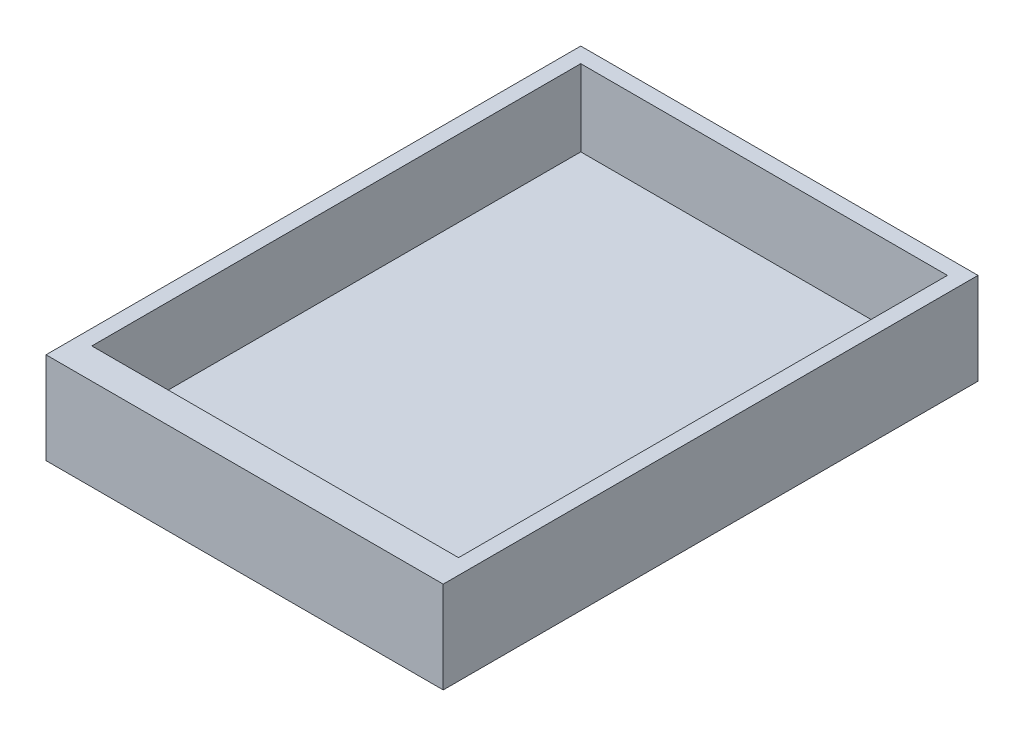
ISO-10303-21;
HEADER;
FILE_DESCRIPTION(('STEP AP214'),'2;1');
FILE_NAME('part.step','',(''),(''),'','','');
FILE_SCHEMA(('AUTOMOTIVE_DESIGN { 1 0 10303 214 1 1 1 1 }'));
ENDSEC;
DATA;
#1=APPLICATION_CONTEXT('core data for automotive mechanical design processes');
#2=APPLICATION_PROTOCOL_DEFINITION('international standard','automotive_design',2000,#1);
#3=PRODUCT_CONTEXT('',#1,'mechanical');
#4=PRODUCT('Part','Part','',(#3));
#5=PRODUCT_RELATED_PRODUCT_CATEGORY('part','',(#4));
#6=PRODUCT_DEFINITION_FORMATION('','',#4);
#7=PRODUCT_DEFINITION_CONTEXT('part definition',#1,'design');
#8=PRODUCT_DEFINITION('design','',#6,#7);
#9=PRODUCT_DEFINITION_SHAPE('','',#8);
#10=(LENGTH_UNIT() NAMED_UNIT(*) SI_UNIT(.MILLI.,.METRE.));
#11=(NAMED_UNIT(*) PLANE_ANGLE_UNIT() SI_UNIT($,.RADIAN.));
#12=(NAMED_UNIT(*) SI_UNIT($,.STERADIAN.) SOLID_ANGLE_UNIT());
#13=UNCERTAINTY_MEASURE_WITH_UNIT(LENGTH_MEASURE(1.E-05),#10,'distance_accuracy_value','');
#14=(GEOMETRIC_REPRESENTATION_CONTEXT(3) GLOBAL_UNCERTAINTY_ASSIGNED_CONTEXT((#13)) GLOBAL_UNIT_ASSIGNED_CONTEXT((#10,
#11,#12)) REPRESENTATION_CONTEXT('',''));
#15=CARTESIAN_POINT('',(0.,0.,0.));
#16=DIRECTION('',(0.,0.,1.));
#17=DIRECTION('',(1.,0.,0.));
#18=AXIS2_PLACEMENT_3D('',#15,#16,#17);
#19=CARTESIAN_POINT('',(41.275,19.05,55.5625));
#20=DIRECTION('',(-1.,0.,0.));
#21=DIRECTION('',(0.,0.,1.));
#22=AXIS2_PLACEMENT_3D('',#19,#20,#21);
#23=PLANE('',#22);
#24=DIRECTION('',(0.,0.,-1.));
#25=VECTOR('',#24,1.);
#26=CARTESIAN_POINT('',(41.275,0.,55.5625));
#27=LINE('',#26,#25);
#28=CARTESIAN_POINT('',(41.275,0.,55.5625));
#29=VERTEX_POINT('',#28);
#30=CARTESIAN_POINT('',(41.275,0.,-55.5625));
#31=VERTEX_POINT('',#30);
#32=EDGE_CURVE('E148',#29,#31,#27,.T.);
#33=ORIENTED_EDGE('',*,*,#32,.T.);
#34=DIRECTION('',(0.,-1.,0.));
#35=VECTOR('',#34,1.);
#36=CARTESIAN_POINT('',(41.275,19.05,-55.5625));
#37=LINE('',#36,#35);
#38=CARTESIAN_POINT('',(41.275,19.05,-55.5625));
#39=VERTEX_POINT('',#38);
#40=EDGE_CURVE('E12',#39,#31,#37,.T.);
#41=ORIENTED_EDGE('',*,*,#40,.F.);
#42=DIRECTION('',(0.,0.,-1.));
#43=VECTOR('',#42,1.);
#44=CARTESIAN_POINT('',(41.275,19.05,55.5625));
#45=LINE('',#44,#43);
#46=CARTESIAN_POINT('',(41.275,19.05,55.5625));
#47=VERTEX_POINT('',#46);
#48=EDGE_CURVE('E149',#47,#39,#45,.T.);
#49=ORIENTED_EDGE('',*,*,#48,.F.);
#50=DIRECTION('',(0.,-1.,0.));
#51=VECTOR('',#50,1.);
#52=CARTESIAN_POINT('',(41.275,19.05,55.5625));
#53=LINE('',#52,#51);
#54=EDGE_CURVE('E155',#47,#29,#53,.T.);
#55=ORIENTED_EDGE('',*,*,#54,.T.);
#56=EDGE_LOOP('',(#33,#41,#49,#55));
#57=FACE_BOUND('',#56,.T.);
#58=ADVANCED_FACE('F37',(#57),#23,.F.);
#59=CARTESIAN_POINT('',(-41.275,19.05,-55.5625));
#60=DIRECTION('',(0.,0.,1.));
#61=DIRECTION('',(1.,0.,0.));
#62=AXIS2_PLACEMENT_3D('',#59,#60,#61);
#63=PLANE('',#62);
#64=DIRECTION('',(-1.,0.,0.));
#65=VECTOR('',#64,1.);
#66=CARTESIAN_POINT('',(-41.275,0.,-55.5625));
#67=LINE('',#66,#65);
#68=CARTESIAN_POINT('',(-41.275,0.,-55.5625));
#69=VERTEX_POINT('',#68);
#70=EDGE_CURVE('E158',#31,#69,#67,.T.);
#71=ORIENTED_EDGE('',*,*,#70,.T.);
#72=DIRECTION('',(0.,-1.,0.));
#73=VECTOR('',#72,1.);
#74=CARTESIAN_POINT('',(-41.275,19.05,-55.5625));
#75=LINE('',#74,#73);
#76=CARTESIAN_POINT('',(-41.275,19.05,-55.5625));
#77=VERTEX_POINT('',#76);
#78=EDGE_CURVE('E44',#77,#69,#75,.T.);
#79=ORIENTED_EDGE('',*,*,#78,.F.);
#80=DIRECTION('',(-1.,0.,0.));
#81=VECTOR('',#80,1.);
#82=CARTESIAN_POINT('',(-41.275,19.05,-55.5625));
#83=LINE('',#82,#81);
#84=EDGE_CURVE('E88',#39,#77,#83,.T.);
#85=ORIENTED_EDGE('',*,*,#84,.F.);
#86=ORIENTED_EDGE('',*,*,#40,.T.);
#87=EDGE_LOOP('',(#71,#79,#85,#86));
#88=FACE_BOUND('',#87,.T.);
#89=ADVANCED_FACE('F187',(#88),#63,.F.);
#90=CARTESIAN_POINT('',(-41.275,19.05,55.5625));
#91=DIRECTION('',(1.,0.,0.));
#92=DIRECTION('',(0.,0.,-1.));
#93=AXIS2_PLACEMENT_3D('',#90,#91,#92);
#94=PLANE('',#93);
#95=DIRECTION('',(0.,0.,1.));
#96=VECTOR('',#95,1.);
#97=CARTESIAN_POINT('',(-41.275,0.,55.5625));
#98=LINE('',#97,#96);
#99=CARTESIAN_POINT('',(-41.275,0.,55.5625));
#100=VERTEX_POINT('',#99);
#101=EDGE_CURVE('E160',#69,#100,#98,.T.);
#102=ORIENTED_EDGE('',*,*,#101,.T.);
#103=DIRECTION('',(0.,-1.,0.));
#104=VECTOR('',#103,1.);
#105=CARTESIAN_POINT('',(-41.275,19.05,55.5625));
#106=LINE('',#105,#104);
#107=CARTESIAN_POINT('',(-41.275,19.05,55.5625));
#108=VERTEX_POINT('',#107);
#109=EDGE_CURVE('E164',#108,#100,#106,.T.);
#110=ORIENTED_EDGE('',*,*,#109,.F.);
#111=DIRECTION('',(0.,0.,1.));
#112=VECTOR('',#111,1.);
#113=CARTESIAN_POINT('',(-41.275,19.05,55.5625));
#114=LINE('',#113,#112);
#115=EDGE_CURVE('E152',#77,#108,#114,.T.);
#116=ORIENTED_EDGE('',*,*,#115,.F.);
#117=ORIENTED_EDGE('',*,*,#78,.T.);
#118=EDGE_LOOP('',(#102,#110,#116,#117));
#119=FACE_BOUND('',#118,.T.);
#120=ADVANCED_FACE('F169',(#119),#94,.F.);
#121=CARTESIAN_POINT('',(-41.275,19.05,55.5625));
#122=DIRECTION('',(0.,0.,-1.));
#123=DIRECTION('',(-1.,0.,0.));
#124=AXIS2_PLACEMENT_3D('',#121,#122,#123);
#125=PLANE('',#124);
#126=DIRECTION('',(1.,0.,0.));
#127=VECTOR('',#126,1.);
#128=CARTESIAN_POINT('',(-41.275,0.,55.5625));
#129=LINE('',#128,#127);
#130=EDGE_CURVE('E81',#100,#29,#129,.T.);
#131=ORIENTED_EDGE('',*,*,#130,.T.);
#132=ORIENTED_EDGE('',*,*,#54,.F.);
#133=DIRECTION('',(1.,0.,0.));
#134=VECTOR('',#133,1.);
#135=CARTESIAN_POINT('',(-41.275,19.05,55.5625));
#136=LINE('',#135,#134);
#137=EDGE_CURVE('E60',#108,#47,#136,.T.);
#138=ORIENTED_EDGE('',*,*,#137,.F.);
#139=ORIENTED_EDGE('',*,*,#109,.T.);
#140=EDGE_LOOP('',(#131,#132,#138,#139));
#141=FACE_BOUND('',#140,.T.);
#142=ADVANCED_FACE('F177',(#141),#125,.F.);
#143=CARTESIAN_POINT('',(41.275,19.05,-55.5625));
#144=DIRECTION('',(0.,-1.,0.));
#145=DIRECTION('',(0.,0.,-1.));
#146=AXIS2_PLACEMENT_3D('',#143,#144,#145);
#147=PLANE('',#146);
#148=DIRECTION('',(0.,0.,1.));
#149=VECTOR('',#148,1.);
#150=CARTESIAN_POINT('',(-38.1,19.05,49.2125));
#151=LINE('',#150,#149);
#152=CARTESIAN_POINT('',(-38.1,19.05,-52.3875));
#153=VERTEX_POINT('',#152);
#154=CARTESIAN_POINT('',(-38.1,19.05,49.2125));
#155=VERTEX_POINT('',#154);
#156=EDGE_CURVE('E134',#153,#155,#151,.T.);
#157=ORIENTED_EDGE('',*,*,#156,.F.);
#158=DIRECTION('',(-1.,0.,0.));
#159=VECTOR('',#158,1.);
#160=CARTESIAN_POINT('',(-38.1,19.05,-52.3875));
#161=LINE('',#160,#159);
#162=CARTESIAN_POINT('',(38.1,19.05,-52.3875));
#163=VERTEX_POINT('',#162);
#164=EDGE_CURVE('E127',#163,#153,#161,.T.);
#165=ORIENTED_EDGE('',*,*,#164,.F.);
#166=DIRECTION('',(0.,0.,-1.));
#167=VECTOR('',#166,1.);
#168=CARTESIAN_POINT('',(38.1,19.05,49.2125));
#169=LINE('',#168,#167);
#170=CARTESIAN_POINT('',(38.1,19.05,49.2125));
#171=VERTEX_POINT('',#170);
#172=EDGE_CURVE('E138',#171,#163,#169,.T.);
#173=ORIENTED_EDGE('',*,*,#172,.F.);
#174=DIRECTION('',(1.,0.,0.));
#175=VECTOR('',#174,1.);
#176=CARTESIAN_POINT('',(-38.1,19.05,49.2125));
#177=LINE('',#176,#175);
#178=EDGE_CURVE('E51',#155,#171,#177,.T.);
#179=ORIENTED_EDGE('',*,*,#178,.F.);
#180=EDGE_LOOP('',(#157,#165,#173,#179));
#181=FACE_BOUND('',#180,.T.);
#182=ORIENTED_EDGE('',*,*,#48,.T.);
#183=ORIENTED_EDGE('',*,*,#84,.T.);
#184=ORIENTED_EDGE('',*,*,#115,.T.);
#185=ORIENTED_EDGE('',*,*,#137,.T.);
#186=EDGE_LOOP('',(#182,#183,#184,#185));
#187=FACE_BOUND('',#186,.T.);
#188=ADVANCED_FACE('F179',(#181,#187),#147,.F.);
#189=CARTESIAN_POINT('',(41.275,0.,-55.5625));
#190=DIRECTION('',(0.,-1.,0.));
#191=DIRECTION('',(0.,0.,-1.));
#192=AXIS2_PLACEMENT_3D('',#189,#190,#191);
#193=PLANE('',#192);
#194=ORIENTED_EDGE('',*,*,#32,.F.);
#195=ORIENTED_EDGE('',*,*,#130,.F.);
#196=ORIENTED_EDGE('',*,*,#101,.F.);
#197=ORIENTED_EDGE('',*,*,#70,.F.);
#198=EDGE_LOOP('',(#194,#195,#196,#197));
#199=FACE_BOUND('',#198,.T.);
#200=ADVANCED_FACE('F173',(#199),#193,.T.);
#201=CARTESIAN_POINT('',(41.275,3.175,-55.5625));
#202=DIRECTION('',(0.,-1.,0.));
#203=DIRECTION('',(0.,0.,-1.));
#204=AXIS2_PLACEMENT_3D('',#201,#202,#203);
#205=PLANE('',#204);
#206=DIRECTION('',(0.,0.,-1.));
#207=VECTOR('',#206,1.);
#208=CARTESIAN_POINT('',(38.1,3.17500000000001,49.2125));
#209=LINE('',#208,#207);
#210=CARTESIAN_POINT('',(38.1,3.17500000000001,49.2125));
#211=VERTEX_POINT('',#210);
#212=CARTESIAN_POINT('',(38.1,3.17500000000001,-52.3875));
#213=VERTEX_POINT('',#212);
#214=EDGE_CURVE('E131',#211,#213,#209,.T.);
#215=ORIENTED_EDGE('',*,*,#214,.T.);
#216=DIRECTION('',(-1.,0.,0.));
#217=VECTOR('',#216,1.);
#218=CARTESIAN_POINT('',(-38.1,3.17500000000001,-52.3875));
#219=LINE('',#218,#217);
#220=CARTESIAN_POINT('',(-38.1,3.17500000000001,-52.3875));
#221=VERTEX_POINT('',#220);
#222=EDGE_CURVE('E124',#213,#221,#219,.T.);
#223=ORIENTED_EDGE('',*,*,#222,.T.);
#224=DIRECTION('',(0.,0.,1.));
#225=VECTOR('',#224,1.);
#226=CARTESIAN_POINT('',(-38.1,3.17500000000001,49.2125));
#227=LINE('',#226,#225);
#228=CARTESIAN_POINT('',(-38.1,3.17500000000001,49.2125));
#229=VERTEX_POINT('',#228);
#230=EDGE_CURVE('E111',#221,#229,#227,.T.);
#231=ORIENTED_EDGE('',*,*,#230,.T.);
#232=DIRECTION('',(1.,0.,0.));
#233=VECTOR('',#232,1.);
#234=CARTESIAN_POINT('',(-38.1,3.17500000000001,49.2125));
#235=LINE('',#234,#233);
#236=EDGE_CURVE('E143',#229,#211,#235,.T.);
#237=ORIENTED_EDGE('',*,*,#236,.T.);
#238=EDGE_LOOP('',(#215,#223,#231,#237));
#239=FACE_BOUND('',#238,.T.);
#240=ADVANCED_FACE('F130',(#239),#205,.F.);
#241=CARTESIAN_POINT('',(-38.1,-127.,-52.3875));
#242=DIRECTION('',(0.,0.,-1.));
#243=DIRECTION('',(-1.,0.,0.));
#244=AXIS2_PLACEMENT_3D('',#241,#242,#243);
#245=PLANE('',#244);
#246=DIRECTION('',(0.,1.,0.));
#247=VECTOR('',#246,1.);
#248=CARTESIAN_POINT('',(38.1,-127.,-52.3875));
#249=LINE('',#248,#247);
#250=EDGE_CURVE('E141',#213,#163,#249,.T.);
#251=ORIENTED_EDGE('',*,*,#250,.T.);
#252=ORIENTED_EDGE('',*,*,#164,.T.);
#253=DIRECTION('',(0.,1.,0.));
#254=VECTOR('',#253,1.);
#255=CARTESIAN_POINT('',(-38.1,-127.,-52.3875));
#256=LINE('',#255,#254);
#257=EDGE_CURVE('E115',#221,#153,#256,.T.);
#258=ORIENTED_EDGE('',*,*,#257,.F.);
#259=ORIENTED_EDGE('',*,*,#222,.F.);
#260=EDGE_LOOP('',(#251,#252,#258,#259));
#261=FACE_BOUND('',#260,.T.);
#262=ADVANCED_FACE('F123',(#261),#245,.F.);
#263=CARTESIAN_POINT('',(-38.1,-127.,49.2125));
#264=DIRECTION('',(-1.,0.,0.));
#265=DIRECTION('',(0.,0.,1.));
#266=AXIS2_PLACEMENT_3D('',#263,#264,#265);
#267=PLANE('',#266);
#268=ORIENTED_EDGE('',*,*,#257,.T.);
#269=ORIENTED_EDGE('',*,*,#156,.T.);
#270=DIRECTION('',(0.,1.,0.));
#271=VECTOR('',#270,1.);
#272=CARTESIAN_POINT('',(-38.1,-127.,49.2125));
#273=LINE('',#272,#271);
#274=EDGE_CURVE('E117',#229,#155,#273,.T.);
#275=ORIENTED_EDGE('',*,*,#274,.F.);
#276=ORIENTED_EDGE('',*,*,#230,.F.);
#277=EDGE_LOOP('',(#268,#269,#275,#276));
#278=FACE_BOUND('',#277,.T.);
#279=ADVANCED_FACE('F113',(#278),#267,.F.);
#280=CARTESIAN_POINT('',(-38.1,-127.,49.2125));
#281=DIRECTION('',(0.,0.,1.));
#282=DIRECTION('',(1.,0.,0.));
#283=AXIS2_PLACEMENT_3D('',#280,#281,#282);
#284=PLANE('',#283);
#285=ORIENTED_EDGE('',*,*,#274,.T.);
#286=ORIENTED_EDGE('',*,*,#178,.T.);
#287=DIRECTION('',(0.,1.,0.));
#288=VECTOR('',#287,1.);
#289=CARTESIAN_POINT('',(38.1,-127.,49.2125));
#290=LINE('',#289,#288);
#291=EDGE_CURVE('E142',#211,#171,#290,.T.);
#292=ORIENTED_EDGE('',*,*,#291,.F.);
#293=ORIENTED_EDGE('',*,*,#236,.F.);
#294=EDGE_LOOP('',(#285,#286,#292,#293));
#295=FACE_BOUND('',#294,.T.);
#296=ADVANCED_FACE('F242',(#295),#284,.F.);
#297=CARTESIAN_POINT('',(38.1,-127.,49.2125));
#298=DIRECTION('',(1.,0.,0.));
#299=DIRECTION('',(0.,0.,-1.));
#300=AXIS2_PLACEMENT_3D('',#297,#298,#299);
#301=PLANE('',#300);
#302=ORIENTED_EDGE('',*,*,#291,.T.);
#303=ORIENTED_EDGE('',*,*,#172,.T.);
#304=ORIENTED_EDGE('',*,*,#250,.F.);
#305=ORIENTED_EDGE('',*,*,#214,.F.);
#306=EDGE_LOOP('',(#302,#303,#304,#305));
#307=FACE_BOUND('',#306,.T.);
#308=ADVANCED_FACE('F251',(#307),#301,.F.);
#309=CLOSED_SHELL('',(#58,#89,#120,#142,#188,#200,#240,#262,#279,#296,#308));
#310=MANIFOLD_SOLID_BREP('B2',#309);
#311=ADVANCED_BREP_SHAPE_REPRESENTATION('',(#18,#310),#14);
#312=SHAPE_DEFINITION_REPRESENTATION(#9,#311);
ENDSEC;
END-ISO-10303-21;
